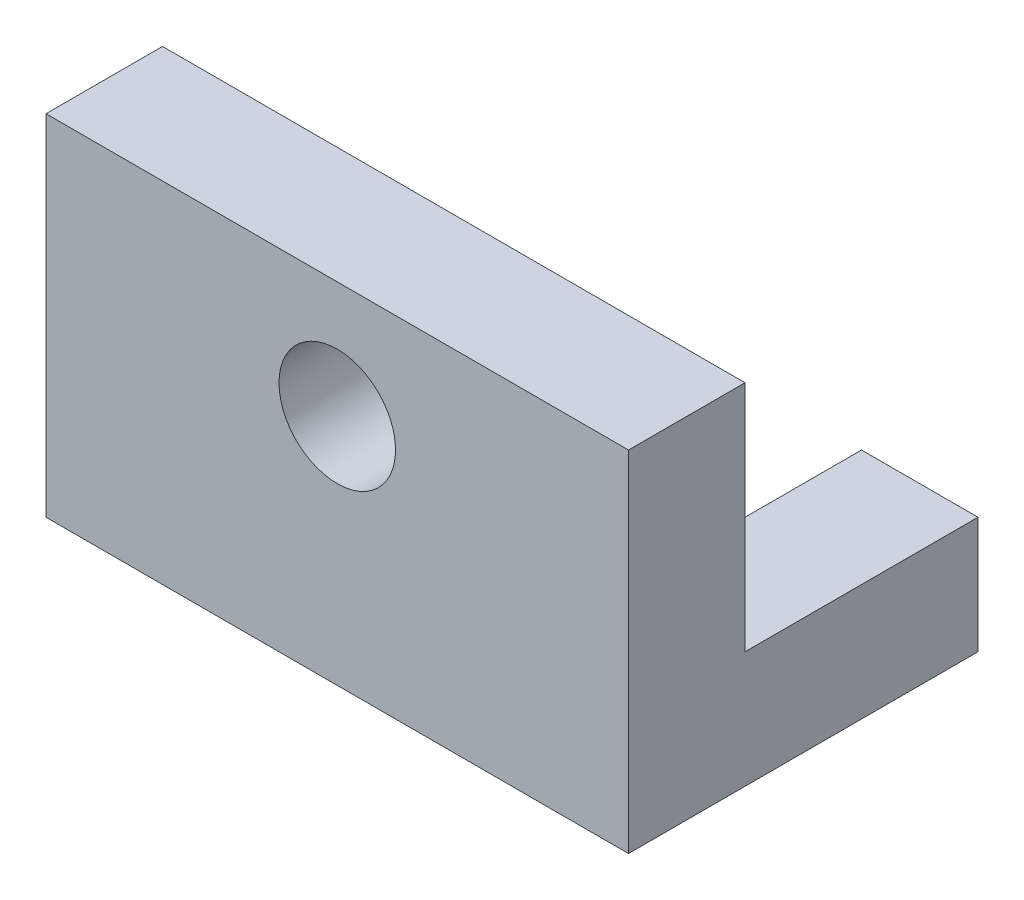
ISO-10303-21;
HEADER;
FILE_DESCRIPTION(('STEP AP214'),'2;1');
FILE_NAME('part.step','',(''),(''),'','','');
FILE_SCHEMA(('AUTOMOTIVE_DESIGN { 1 0 10303 214 1 1 1 1 }'));
ENDSEC;
DATA;
#1=APPLICATION_CONTEXT('core data for automotive mechanical design processes');
#2=APPLICATION_PROTOCOL_DEFINITION('international standard','automotive_design',2000,#1);
#3=PRODUCT_CONTEXT('',#1,'mechanical');
#4=PRODUCT('Part','Part','',(#3));
#5=PRODUCT_RELATED_PRODUCT_CATEGORY('part','',(#4));
#6=PRODUCT_DEFINITION_FORMATION('','',#4);
#7=PRODUCT_DEFINITION_CONTEXT('part definition',#1,'design');
#8=PRODUCT_DEFINITION('design','',#6,#7);
#9=PRODUCT_DEFINITION_SHAPE('','',#8);
#10=(LENGTH_UNIT() NAMED_UNIT(*) SI_UNIT(.MILLI.,.METRE.));
#11=(NAMED_UNIT(*) PLANE_ANGLE_UNIT() SI_UNIT($,.RADIAN.));
#12=(NAMED_UNIT(*) SI_UNIT($,.STERADIAN.) SOLID_ANGLE_UNIT());
#13=UNCERTAINTY_MEASURE_WITH_UNIT(LENGTH_MEASURE(1.E-05),#10,'distance_accuracy_value','');
#14=(GEOMETRIC_REPRESENTATION_CONTEXT(3) GLOBAL_UNCERTAINTY_ASSIGNED_CONTEXT((#13)) GLOBAL_UNIT_ASSIGNED_CONTEXT((#10,
#11,#12)) REPRESENTATION_CONTEXT('',''));
#15=CARTESIAN_POINT('',(0.,0.,0.));
#16=DIRECTION('',(0.,0.,1.));
#17=DIRECTION('',(1.,0.,0.));
#18=AXIS2_PLACEMENT_3D('',#15,#16,#17);
#19=CARTESIAN_POINT('',(50.,0.,-60.));
#20=DIRECTION('',(0.,0.,1.));
#21=DIRECTION('',(1.,0.,0.));
#22=AXIS2_PLACEMENT_3D('',#19,#20,#21);
#23=PLANE('',#22);
#24=DIRECTION('',(-1.,0.,0.));
#25=VECTOR('',#24,1.);
#26=CARTESIAN_POINT('',(50.,20.,-60.));
#27=LINE('',#26,#25);
#28=CARTESIAN_POINT('',(-30.,20.,-60.));
#29=VERTEX_POINT('',#28);
#30=CARTESIAN_POINT('',(-50.,20.,-60.));
#31=VERTEX_POINT('',#30);
#32=EDGE_CURVE('E121',#29,#31,#27,.T.);
#33=ORIENTED_EDGE('',*,*,#32,.F.);
#34=DIRECTION('',(0.,1.,0.));
#35=VECTOR('',#34,1.);
#36=CARTESIAN_POINT('',(-30.,-0.001000000000001,-60.));
#37=LINE('',#36,#35);
#38=CARTESIAN_POINT('',(-30.,0.,-60.));
#39=VERTEX_POINT('',#38);
#40=EDGE_CURVE('E158',#39,#29,#37,.T.);
#41=ORIENTED_EDGE('',*,*,#40,.F.);
#42=DIRECTION('',(-1.,0.,0.));
#43=VECTOR('',#42,1.);
#44=CARTESIAN_POINT('',(50.,0.,-60.));
#45=LINE('',#44,#43);
#46=CARTESIAN_POINT('',(-50.,0.,-60.));
#47=VERTEX_POINT('',#46);
#48=EDGE_CURVE('E148',#39,#47,#45,.T.);
#49=ORIENTED_EDGE('',*,*,#48,.T.);
#50=DIRECTION('',(0.,1.,0.));
#51=VECTOR('',#50,1.);
#52=CARTESIAN_POINT('',(-50.,0.,-60.));
#53=LINE('',#52,#51);
#54=EDGE_CURVE('E137',#47,#31,#53,.T.);
#55=ORIENTED_EDGE('',*,*,#54,.T.);
#56=EDGE_LOOP('',(#33,#41,#49,#55));
#57=FACE_BOUND('',#56,.T.);
#58=ADVANCED_FACE('F33',(#57),#23,.F.);
#59=CARTESIAN_POINT('',(50.,0.,0.));
#60=DIRECTION('',(0.,0.,-1.));
#61=DIRECTION('',(-1.,0.,0.));
#62=AXIS2_PLACEMENT_3D('',#59,#60,#61);
#63=PLANE('',#62);
#64=CARTESIAN_POINT('',(0.,40.,0.));
#65=DIRECTION('',(0.,0.,-1.));
#66=DIRECTION('',(-1.,0.,0.));
#67=AXIS2_PLACEMENT_3D('',#64,#65,#66);
#68=CIRCLE('',#67,10.);
#69=CARTESIAN_POINT('',(-10.,40.,0.));
#70=VERTEX_POINT('',#69);
#71=EDGE_CURVE('E134',#70,#70,#68,.T.);
#72=ORIENTED_EDGE('',*,*,#71,.T.);
#73=EDGE_LOOP('',(#72));
#74=FACE_BOUND('',#73,.T.);
#75=DIRECTION('',(0.,-1.,0.));
#76=VECTOR('',#75,1.);
#77=CARTESIAN_POINT('',(-50.,0.,0.));
#78=LINE('',#77,#76);
#79=CARTESIAN_POINT('',(-50.,60.,0.));
#80=VERTEX_POINT('',#79);
#81=CARTESIAN_POINT('',(-50.,0.,0.));
#82=VERTEX_POINT('',#81);
#83=EDGE_CURVE('E130',#80,#82,#78,.T.);
#84=ORIENTED_EDGE('',*,*,#83,.T.);
#85=DIRECTION('',(-1.,0.,0.));
#86=VECTOR('',#85,1.);
#87=CARTESIAN_POINT('',(50.,0.,0.));
#88=LINE('',#87,#86);
#89=CARTESIAN_POINT('',(50.,0.,0.));
#90=VERTEX_POINT('',#89);
#91=EDGE_CURVE('E11',#90,#82,#88,.T.);
#92=ORIENTED_EDGE('',*,*,#91,.F.);
#93=DIRECTION('',(0.,-1.,0.));
#94=VECTOR('',#93,1.);
#95=CARTESIAN_POINT('',(50.,0.,0.));
#96=LINE('',#95,#94);
#97=CARTESIAN_POINT('',(50.,60.,0.));
#98=VERTEX_POINT('',#97);
#99=EDGE_CURVE('E144',#98,#90,#96,.T.);
#100=ORIENTED_EDGE('',*,*,#99,.F.);
#101=DIRECTION('',(-1.,0.,0.));
#102=VECTOR('',#101,1.);
#103=CARTESIAN_POINT('',(50.,60.,0.));
#104=LINE('',#103,#102);
#105=EDGE_CURVE('E126',#98,#80,#104,.T.);
#106=ORIENTED_EDGE('',*,*,#105,.T.);
#107=EDGE_LOOP('',(#84,#92,#100,#106));
#108=FACE_BOUND('',#107,.T.);
#109=ADVANCED_FACE('F35',(#74,#108),#63,.F.);
#110=CARTESIAN_POINT('',(50.,0.,0.));
#111=DIRECTION('',(0.,1.,0.));
#112=DIRECTION('',(0.,0.,1.));
#113=AXIS2_PLACEMENT_3D('',#110,#111,#112);
#114=PLANE('',#113);
#115=ORIENTED_EDGE('',*,*,#48,.F.);
#116=DIRECTION('',(0.,0.,-1.));
#117=VECTOR('',#116,1.);
#118=CARTESIAN_POINT('',(-30.,0.,-60.));
#119=LINE('',#118,#117);
#120=CARTESIAN_POINT('',(-30.,0.,-40.));
#121=VERTEX_POINT('',#120);
#122=EDGE_CURVE('E194',#121,#39,#119,.T.);
#123=ORIENTED_EDGE('',*,*,#122,.F.);
#124=DIRECTION('',(-1.,0.,0.));
#125=VECTOR('',#124,1.);
#126=CARTESIAN_POINT('',(-30.,0.,-40.));
#127=LINE('',#126,#125);
#128=CARTESIAN_POINT('',(30.,0.,-40.));
#129=VERTEX_POINT('',#128);
#130=EDGE_CURVE('E174',#129,#121,#127,.T.);
#131=ORIENTED_EDGE('',*,*,#130,.F.);
#132=DIRECTION('',(0.,0.,1.));
#133=VECTOR('',#132,1.);
#134=CARTESIAN_POINT('',(30.,0.,-60.));
#135=LINE('',#134,#133);
#136=CARTESIAN_POINT('',(30.,0.,-60.));
#137=VERTEX_POINT('',#136);
#138=EDGE_CURVE('E197',#137,#129,#135,.T.);
#139=ORIENTED_EDGE('',*,*,#138,.F.);
#140=CARTESIAN_POINT('',(50.,0.,-60.));
#141=VERTEX_POINT('',#140);
#142=EDGE_CURVE('E41',#141,#137,#45,.T.);
#143=ORIENTED_EDGE('',*,*,#142,.F.);
#144=DIRECTION('',(0.,0.,-1.));
#145=VECTOR('',#144,1.);
#146=CARTESIAN_POINT('',(50.,0.,0.));
#147=LINE('',#146,#145);
#148=EDGE_CURVE('E92',#90,#141,#147,.T.);
#149=ORIENTED_EDGE('',*,*,#148,.F.);
#150=ORIENTED_EDGE('',*,*,#91,.T.);
#151=DIRECTION('',(0.,0.,-1.));
#152=VECTOR('',#151,1.);
#153=CARTESIAN_POINT('',(-50.,0.,0.));
#154=LINE('',#153,#152);
#155=EDGE_CURVE('E133',#82,#47,#154,.T.);
#156=ORIENTED_EDGE('',*,*,#155,.T.);
#157=EDGE_LOOP('',(#115,#123,#131,#139,#143,#149,#150,#156));
#158=FACE_BOUND('',#157,.T.);
#159=ADVANCED_FACE('F160',(#158),#114,.F.);
#160=ORIENTED_EDGE('',*,*,#142,.T.);
#161=DIRECTION('',(0.,1.,0.));
#162=VECTOR('',#161,1.);
#163=CARTESIAN_POINT('',(30.,-0.001000000000001,-60.));
#164=LINE('',#163,#162);
#165=CARTESIAN_POINT('',(30.,20.,-60.));
#166=VERTEX_POINT('',#165);
#167=EDGE_CURVE('E185',#137,#166,#164,.T.);
#168=ORIENTED_EDGE('',*,*,#167,.T.);
#169=CARTESIAN_POINT('',(50.,20.,-60.));
#170=VERTEX_POINT('',#169);
#171=EDGE_CURVE('E147',#170,#166,#27,.T.);
#172=ORIENTED_EDGE('',*,*,#171,.F.);
#173=DIRECTION('',(0.,1.,0.));
#174=VECTOR('',#173,1.);
#175=CARTESIAN_POINT('',(50.,0.,-60.));
#176=LINE('',#175,#174);
#177=EDGE_CURVE('E108',#141,#170,#176,.T.);
#178=ORIENTED_EDGE('',*,*,#177,.F.);
#179=EDGE_LOOP('',(#160,#168,#172,#178));
#180=FACE_BOUND('',#179,.T.);
#181=ADVANCED_FACE('F219',(#180),#23,.F.);
#182=CARTESIAN_POINT('',(50.,20.,-20.));
#183=DIRECTION('',(0.,-1.,0.));
#184=DIRECTION('',(0.,0.,-1.));
#185=AXIS2_PLACEMENT_3D('',#182,#183,#184);
#186=PLANE('',#185);
#187=DIRECTION('',(1.,0.,0.));
#188=VECTOR('',#187,1.);
#189=CARTESIAN_POINT('',(-30.,20.,-40.));
#190=LINE('',#189,#188);
#191=CARTESIAN_POINT('',(-30.,20.,-40.));
#192=VERTEX_POINT('',#191);
#193=CARTESIAN_POINT('',(30.,20.,-40.));
#194=VERTEX_POINT('',#193);
#195=EDGE_CURVE('E190',#192,#194,#190,.T.);
#196=ORIENTED_EDGE('',*,*,#195,.F.);
#197=DIRECTION('',(0.,0.,1.));
#198=VECTOR('',#197,1.);
#199=CARTESIAN_POINT('',(-30.,20.,-60.));
#200=LINE('',#199,#198);
#201=EDGE_CURVE('E48',#29,#192,#200,.T.);
#202=ORIENTED_EDGE('',*,*,#201,.F.);
#203=ORIENTED_EDGE('',*,*,#32,.T.);
#204=DIRECTION('',(0.,0.,1.));
#205=VECTOR('',#204,1.);
#206=CARTESIAN_POINT('',(-50.,20.,-20.));
#207=LINE('',#206,#205);
#208=CARTESIAN_POINT('',(-50.,20.,-20.));
#209=VERTEX_POINT('',#208);
#210=EDGE_CURVE('E118',#31,#209,#207,.T.);
#211=ORIENTED_EDGE('',*,*,#210,.T.);
#212=DIRECTION('',(-1.,0.,0.));
#213=VECTOR('',#212,1.);
#214=CARTESIAN_POINT('',(50.,20.,-20.));
#215=LINE('',#214,#213);
#216=CARTESIAN_POINT('',(50.,20.,-20.));
#217=VERTEX_POINT('',#216);
#218=EDGE_CURVE('E114',#217,#209,#215,.T.);
#219=ORIENTED_EDGE('',*,*,#218,.F.);
#220=DIRECTION('',(0.,0.,1.));
#221=VECTOR('',#220,1.);
#222=CARTESIAN_POINT('',(50.,20.,-20.));
#223=LINE('',#222,#221);
#224=EDGE_CURVE('E101',#170,#217,#223,.T.);
#225=ORIENTED_EDGE('',*,*,#224,.F.);
#226=ORIENTED_EDGE('',*,*,#171,.T.);
#227=DIRECTION('',(0.,0.,-1.));
#228=VECTOR('',#227,1.);
#229=CARTESIAN_POINT('',(30.,20.,-60.));
#230=LINE('',#229,#228);
#231=EDGE_CURVE('E182',#194,#166,#230,.T.);
#232=ORIENTED_EDGE('',*,*,#231,.F.);
#233=EDGE_LOOP('',(#196,#202,#203,#211,#219,#225,#226,#232));
#234=FACE_BOUND('',#233,.T.);
#235=ADVANCED_FACE('F116',(#234),#186,.F.);
#236=CARTESIAN_POINT('',(50.,20.,-20.));
#237=DIRECTION('',(0.,0.,1.));
#238=DIRECTION('',(1.,0.,0.));
#239=AXIS2_PLACEMENT_3D('',#236,#237,#238);
#240=PLANE('',#239);
#241=CARTESIAN_POINT('',(0.,40.,-20.));
#242=DIRECTION('',(0.,0.,-1.));
#243=DIRECTION('',(-1.,0.,0.));
#244=AXIS2_PLACEMENT_3D('',#241,#242,#243);
#245=CIRCLE('',#244,10.);
#246=CARTESIAN_POINT('',(-10.,40.,-20.));
#247=VERTEX_POINT('',#246);
#248=EDGE_CURVE('E171',#247,#247,#245,.T.);
#249=ORIENTED_EDGE('',*,*,#248,.F.);
#250=EDGE_LOOP('',(#249));
#251=FACE_BOUND('',#250,.T.);
#252=DIRECTION('',(0.,1.,0.));
#253=VECTOR('',#252,1.);
#254=CARTESIAN_POINT('',(-50.,20.,-20.));
#255=LINE('',#254,#253);
#256=CARTESIAN_POINT('',(-50.,60.,-20.));
#257=VERTEX_POINT('',#256);
#258=EDGE_CURVE('E141',#209,#257,#255,.T.);
#259=ORIENTED_EDGE('',*,*,#258,.T.);
#260=DIRECTION('',(-1.,0.,0.));
#261=VECTOR('',#260,1.);
#262=CARTESIAN_POINT('',(50.,60.,-20.));
#263=LINE('',#262,#261);
#264=CARTESIAN_POINT('',(50.,60.,-20.));
#265=VERTEX_POINT('',#264);
#266=EDGE_CURVE('E122',#265,#257,#263,.T.);
#267=ORIENTED_EDGE('',*,*,#266,.F.);
#268=DIRECTION('',(0.,1.,0.));
#269=VECTOR('',#268,1.);
#270=CARTESIAN_POINT('',(50.,20.,-20.));
#271=LINE('',#270,#269);
#272=EDGE_CURVE('E105',#217,#265,#271,.T.);
#273=ORIENTED_EDGE('',*,*,#272,.F.);
#274=ORIENTED_EDGE('',*,*,#218,.T.);
#275=EDGE_LOOP('',(#259,#267,#273,#274));
#276=FACE_BOUND('',#275,.T.);
#277=ADVANCED_FACE('F124',(#251,#276),#240,.F.);
#278=CARTESIAN_POINT('',(50.,60.,0.));
#279=DIRECTION('',(0.,-1.,0.));
#280=DIRECTION('',(0.,0.,-1.));
#281=AXIS2_PLACEMENT_3D('',#278,#279,#280);
#282=PLANE('',#281);
#283=DIRECTION('',(0.,0.,1.));
#284=VECTOR('',#283,1.);
#285=CARTESIAN_POINT('',(-50.,60.,0.));
#286=LINE('',#285,#284);
#287=EDGE_CURVE('E84',#257,#80,#286,.T.);
#288=ORIENTED_EDGE('',*,*,#287,.T.);
#289=ORIENTED_EDGE('',*,*,#105,.F.);
#290=DIRECTION('',(0.,0.,1.));
#291=VECTOR('',#290,1.);
#292=CARTESIAN_POINT('',(50.,60.,0.));
#293=LINE('',#292,#291);
#294=EDGE_CURVE('E57',#265,#98,#293,.T.);
#295=ORIENTED_EDGE('',*,*,#294,.F.);
#296=ORIENTED_EDGE('',*,*,#266,.T.);
#297=EDGE_LOOP('',(#288,#289,#295,#296));
#298=FACE_BOUND('',#297,.T.);
#299=ADVANCED_FACE('F165',(#298),#282,.F.);
#300=CARTESIAN_POINT('',(50.,0.,0.));
#301=DIRECTION('',(-1.,0.,0.));
#302=DIRECTION('',(0.,0.,1.));
#303=AXIS2_PLACEMENT_3D('',#300,#301,#302);
#304=PLANE('',#303);
#305=ORIENTED_EDGE('',*,*,#99,.T.);
#306=ORIENTED_EDGE('',*,*,#148,.T.);
#307=ORIENTED_EDGE('',*,*,#177,.T.);
#308=ORIENTED_EDGE('',*,*,#224,.T.);
#309=ORIENTED_EDGE('',*,*,#272,.T.);
#310=ORIENTED_EDGE('',*,*,#294,.T.);
#311=EDGE_LOOP('',(#305,#306,#307,#308,#309,#310));
#312=FACE_BOUND('',#311,.T.);
#313=ADVANCED_FACE('F103',(#312),#304,.F.);
#314=CARTESIAN_POINT('',(-50.,0.,0.));
#315=DIRECTION('',(-1.,0.,0.));
#316=DIRECTION('',(0.,0.,1.));
#317=AXIS2_PLACEMENT_3D('',#314,#315,#316);
#318=PLANE('',#317);
#319=ORIENTED_EDGE('',*,*,#83,.F.);
#320=ORIENTED_EDGE('',*,*,#287,.F.);
#321=ORIENTED_EDGE('',*,*,#258,.F.);
#322=ORIENTED_EDGE('',*,*,#210,.F.);
#323=ORIENTED_EDGE('',*,*,#54,.F.);
#324=ORIENTED_EDGE('',*,*,#155,.F.);
#325=EDGE_LOOP('',(#319,#320,#321,#322,#323,#324));
#326=FACE_BOUND('',#325,.T.);
#327=ADVANCED_FACE('F164',(#326),#318,.T.);
#328=CARTESIAN_POINT('',(0.,40.,0.));
#329=DIRECTION('',(0.,0.,-1.));
#330=DIRECTION('',(-1.,0.,0.));
#331=AXIS2_PLACEMENT_3D('',#328,#329,#330);
#332=CYLINDRICAL_SURFACE('',#331,10.);
#333=ORIENTED_EDGE('',*,*,#71,.F.);
#334=EDGE_LOOP('',(#333));
#335=FACE_BOUND('',#334,.T.);
#336=ORIENTED_EDGE('',*,*,#248,.T.);
#337=EDGE_LOOP('',(#336));
#338=FACE_BOUND('',#337,.T.);
#339=ADVANCED_FACE('F236',(#335,#338),#332,.F.);
#340=CARTESIAN_POINT('',(-30.,-0.001000000000001,-60.));
#341=DIRECTION('',(-1.,0.,0.));
#342=DIRECTION('',(0.,0.,1.));
#343=AXIS2_PLACEMENT_3D('',#340,#341,#342);
#344=PLANE('',#343);
#345=ORIENTED_EDGE('',*,*,#122,.T.);
#346=ORIENTED_EDGE('',*,*,#40,.T.);
#347=ORIENTED_EDGE('',*,*,#201,.T.);
#348=DIRECTION('',(0.,1.,0.));
#349=VECTOR('',#348,1.);
#350=CARTESIAN_POINT('',(-30.,-0.001000000000001,-40.));
#351=LINE('',#350,#349);
#352=EDGE_CURVE('E179',#121,#192,#351,.T.);
#353=ORIENTED_EDGE('',*,*,#352,.F.);
#354=EDGE_LOOP('',(#345,#346,#347,#353));
#355=FACE_BOUND('',#354,.T.);
#356=ADVANCED_FACE('F217',(#355),#344,.F.);
#357=CARTESIAN_POINT('',(30.,-0.001000000000001,-60.));
#358=DIRECTION('',(1.,0.,0.));
#359=DIRECTION('',(0.,0.,-1.));
#360=AXIS2_PLACEMENT_3D('',#357,#358,#359);
#361=PLANE('',#360);
#362=ORIENTED_EDGE('',*,*,#138,.T.);
#363=DIRECTION('',(0.,1.,0.));
#364=VECTOR('',#363,1.);
#365=CARTESIAN_POINT('',(30.,-0.001000000000001,-40.));
#366=LINE('',#365,#364);
#367=EDGE_CURVE('E181',#129,#194,#366,.T.);
#368=ORIENTED_EDGE('',*,*,#367,.T.);
#369=ORIENTED_EDGE('',*,*,#231,.T.);
#370=ORIENTED_EDGE('',*,*,#167,.F.);
#371=EDGE_LOOP('',(#362,#368,#369,#370));
#372=FACE_BOUND('',#371,.T.);
#373=ADVANCED_FACE('F204',(#372),#361,.F.);
#374=CARTESIAN_POINT('',(-30.,-0.001000000000001,-40.));
#375=DIRECTION('',(0.,0.,1.));
#376=DIRECTION('',(1.,0.,0.));
#377=AXIS2_PLACEMENT_3D('',#374,#375,#376);
#378=PLANE('',#377);
#379=ORIENTED_EDGE('',*,*,#130,.T.);
#380=ORIENTED_EDGE('',*,*,#352,.T.);
#381=ORIENTED_EDGE('',*,*,#195,.T.);
#382=ORIENTED_EDGE('',*,*,#367,.F.);
#383=EDGE_LOOP('',(#379,#380,#381,#382));
#384=FACE_BOUND('',#383,.T.);
#385=ADVANCED_FACE('F211',(#384),#378,.F.);
#386=CLOSED_SHELL('',(#58,#109,#159,#181,#235,#277,#299,#313,#327,#339,#356,#373,#385));
#387=MANIFOLD_SOLID_BREP('B2',#386);
#388=ADVANCED_BREP_SHAPE_REPRESENTATION('',(#18,#387),#14);
#389=SHAPE_DEFINITION_REPRESENTATION(#9,#388);
ENDSEC;
END-ISO-10303-21;
